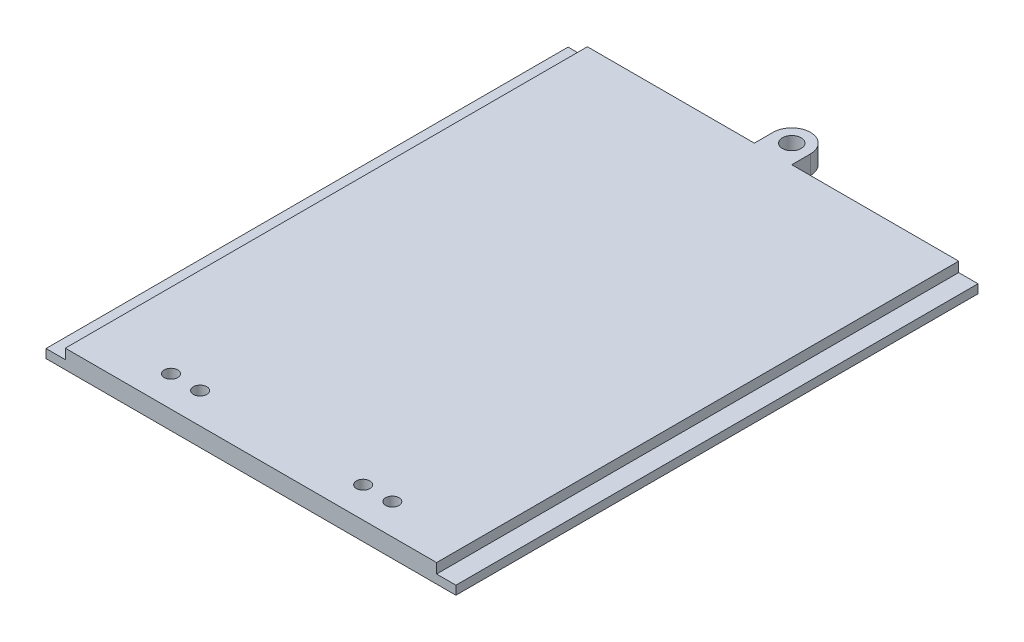
ISO-10303-21;
HEADER;
FILE_DESCRIPTION(('STEP AP214'),'2;1');
FILE_NAME('part.step','',(''),(''),'','','');
FILE_SCHEMA(('AUTOMOTIVE_DESIGN { 1 0 10303 214 1 1 1 1 }'));
ENDSEC;
DATA;
#1=APPLICATION_CONTEXT('core data for automotive mechanical design processes');
#2=APPLICATION_PROTOCOL_DEFINITION('international standard','automotive_design',2000,#1);
#3=PRODUCT_CONTEXT('',#1,'mechanical');
#4=PRODUCT('Part','Part','',(#3));
#5=PRODUCT_RELATED_PRODUCT_CATEGORY('part','',(#4));
#6=PRODUCT_DEFINITION_FORMATION('','',#4);
#7=PRODUCT_DEFINITION_CONTEXT('part definition',#1,'design');
#8=PRODUCT_DEFINITION('design','',#6,#7);
#9=PRODUCT_DEFINITION_SHAPE('','',#8);
#10=(LENGTH_UNIT() NAMED_UNIT(*) SI_UNIT(.MILLI.,.METRE.));
#11=(NAMED_UNIT(*) PLANE_ANGLE_UNIT() SI_UNIT($,.RADIAN.));
#12=(NAMED_UNIT(*) SI_UNIT($,.STERADIAN.) SOLID_ANGLE_UNIT());
#13=UNCERTAINTY_MEASURE_WITH_UNIT(LENGTH_MEASURE(1.E-05),#10,'distance_accuracy_value','');
#14=(GEOMETRIC_REPRESENTATION_CONTEXT(3) GLOBAL_UNCERTAINTY_ASSIGNED_CONTEXT((#13)) GLOBAL_UNIT_ASSIGNED_CONTEXT((#10,
#11,#12)) REPRESENTATION_CONTEXT('',''));
#15=CARTESIAN_POINT('',(0.,0.,0.));
#16=DIRECTION('',(0.,0.,1.));
#17=DIRECTION('',(1.,0.,0.));
#18=AXIS2_PLACEMENT_3D('',#15,#16,#17);
#19=CARTESIAN_POINT('',(0.,6.35,-177.292));
#20=DIRECTION('',(0.,0.,1.));
#21=DIRECTION('',(1.,0.,0.));
#22=AXIS2_PLACEMENT_3D('',#19,#20,#21);
#23=PLANE('',#22);
#24=DIRECTION('',(0.,1.,0.));
#25=VECTOR('',#24,1.);
#26=CARTESIAN_POINT('',(63.246,0.,-177.292));
#27=LINE('',#26,#25);
#28=CARTESIAN_POINT('',(63.246,0.,-177.292));
#29=VERTEX_POINT('',#28);
#30=CARTESIAN_POINT('',(63.246,6.35,-177.292));
#31=VERTEX_POINT('',#30);
#32=EDGE_CURVE('E134',#29,#31,#27,.T.);
#33=ORIENTED_EDGE('',*,*,#32,.F.);
#34=DIRECTION('',(-1.,0.,0.));
#35=VECTOR('',#34,1.);
#36=CARTESIAN_POINT('',(0.,0.,-177.292));
#37=LINE('',#36,#35);
#38=CARTESIAN_POINT('',(0.,0.,-177.292));
#39=VERTEX_POINT('',#38);
#40=EDGE_CURVE('E144',#29,#39,#37,.T.);
#41=ORIENTED_EDGE('',*,*,#40,.T.);
#42=DIRECTION('',(0.,-1.,0.));
#43=VECTOR('',#42,1.);
#44=CARTESIAN_POINT('',(0.,6.35,-177.292));
#45=LINE('',#44,#43);
#46=CARTESIAN_POINT('',(0.,2.975,-177.292));
#47=VERTEX_POINT('',#46);
#48=EDGE_CURVE('E165',#47,#39,#45,.T.);
#49=ORIENTED_EDGE('',*,*,#48,.F.);
#50=DIRECTION('',(-1.,0.,0.));
#51=VECTOR('',#50,1.);
#52=CARTESIAN_POINT('',(0.,2.975,-177.292));
#53=LINE('',#52,#51);
#54=CARTESIAN_POINT('',(6.55,2.975,-177.292));
#55=VERTEX_POINT('',#54);
#56=EDGE_CURVE('E218',#55,#47,#53,.T.);
#57=ORIENTED_EDGE('',*,*,#56,.F.);
#58=DIRECTION('',(0.,1.,0.));
#59=VECTOR('',#58,1.);
#60=CARTESIAN_POINT('',(6.55,2.975,-177.292));
#61=LINE('',#60,#59);
#62=CARTESIAN_POINT('',(6.55,6.35,-177.292));
#63=VERTEX_POINT('',#62);
#64=EDGE_CURVE('E224',#55,#63,#61,.T.);
#65=ORIENTED_EDGE('',*,*,#64,.T.);
#66=DIRECTION('',(-1.,0.,0.));
#67=VECTOR('',#66,1.);
#68=CARTESIAN_POINT('',(0.,6.35,-177.292));
#69=LINE('',#68,#67);
#70=EDGE_CURVE('E147',#31,#63,#69,.T.);
#71=ORIENTED_EDGE('',*,*,#70,.F.);
#72=EDGE_LOOP('',(#33,#41,#49,#57,#65,#71));
#73=FACE_BOUND('',#72,.T.);
#74=ADVANCED_FACE('F37',(#73),#23,.F.);
#75=CARTESIAN_POINT('',(0.,6.35,0.));
#76=DIRECTION('',(1.,0.,0.));
#77=DIRECTION('',(0.,0.,-1.));
#78=AXIS2_PLACEMENT_3D('',#75,#76,#77);
#79=PLANE('',#78);
#80=DIRECTION('',(0.,0.,1.));
#81=VECTOR('',#80,1.);
#82=CARTESIAN_POINT('',(0.,2.975,-177.292));
#83=LINE('',#82,#81);
#84=CARTESIAN_POINT('',(0.,2.975,0.));
#85=VERTEX_POINT('',#84);
#86=EDGE_CURVE('E209',#47,#85,#83,.T.);
#87=ORIENTED_EDGE('',*,*,#86,.F.);
#88=ORIENTED_EDGE('',*,*,#48,.T.);
#89=DIRECTION('',(0.,0.,1.));
#90=VECTOR('',#89,1.);
#91=CARTESIAN_POINT('',(0.,0.,0.));
#92=LINE('',#91,#90);
#93=CARTESIAN_POINT('',(0.,0.,0.));
#94=VERTEX_POINT('',#93);
#95=EDGE_CURVE('E154',#39,#94,#92,.T.);
#96=ORIENTED_EDGE('',*,*,#95,.T.);
#97=DIRECTION('',(0.,-1.,0.));
#98=VECTOR('',#97,1.);
#99=CARTESIAN_POINT('',(0.,6.35,0.));
#100=LINE('',#99,#98);
#101=EDGE_CURVE('E172',#85,#94,#100,.T.);
#102=ORIENTED_EDGE('',*,*,#101,.F.);
#103=EDGE_LOOP('',(#87,#88,#96,#102));
#104=FACE_BOUND('',#103,.T.);
#105=ADVANCED_FACE('F279',(#104),#79,.F.);
#106=CARTESIAN_POINT('',(139.192,6.35,0.));
#107=DIRECTION('',(-1.,0.,0.));
#108=DIRECTION('',(0.,0.,1.));
#109=AXIS2_PLACEMENT_3D('',#106,#107,#108);
#110=PLANE('',#109);
#111=DIRECTION('',(0.,0.,-1.));
#112=VECTOR('',#111,1.);
#113=CARTESIAN_POINT('',(139.192,2.975,-177.292));
#114=LINE('',#113,#112);
#115=CARTESIAN_POINT('',(139.192,2.975,0.));
#116=VERTEX_POINT('',#115);
#117=CARTESIAN_POINT('',(139.192,2.975,-177.292));
#118=VERTEX_POINT('',#117);
#119=EDGE_CURVE('E235',#116,#118,#114,.T.);
#120=ORIENTED_EDGE('',*,*,#119,.F.);
#121=DIRECTION('',(0.,-1.,0.));
#122=VECTOR('',#121,1.);
#123=CARTESIAN_POINT('',(139.192,6.35,0.));
#124=LINE('',#123,#122);
#125=CARTESIAN_POINT('',(139.192,0.,0.));
#126=VERTEX_POINT('',#125);
#127=EDGE_CURVE('E170',#116,#126,#124,.T.);
#128=ORIENTED_EDGE('',*,*,#127,.T.);
#129=DIRECTION('',(0.,0.,-1.));
#130=VECTOR('',#129,1.);
#131=CARTESIAN_POINT('',(139.192,0.,0.));
#132=LINE('',#131,#130);
#133=CARTESIAN_POINT('',(139.192,0.,-177.292));
#134=VERTEX_POINT('',#133);
#135=EDGE_CURVE('E156',#126,#134,#132,.T.);
#136=ORIENTED_EDGE('',*,*,#135,.T.);
#137=DIRECTION('',(0.,-1.,0.));
#138=VECTOR('',#137,1.);
#139=CARTESIAN_POINT('',(139.192,6.35,-177.292));
#140=LINE('',#139,#138);
#141=EDGE_CURVE('E167',#118,#134,#140,.T.);
#142=ORIENTED_EDGE('',*,*,#141,.F.);
#143=EDGE_LOOP('',(#120,#128,#136,#142));
#144=FACE_BOUND('',#143,.T.);
#145=ADVANCED_FACE('F259',(#144),#110,.F.);
#146=CARTESIAN_POINT('',(0.,6.35,0.));
#147=DIRECTION('',(0.,0.,-1.));
#148=DIRECTION('',(-1.,0.,0.));
#149=AXIS2_PLACEMENT_3D('',#146,#147,#148);
#150=PLANE('',#149);
#151=DIRECTION('',(1.,0.,0.));
#152=VECTOR('',#151,1.);
#153=CARTESIAN_POINT('',(0.,6.35,0.));
#154=LINE('',#153,#152);
#155=CARTESIAN_POINT('',(6.55000000000002,6.35,0.));
#156=VERTEX_POINT('',#155);
#157=CARTESIAN_POINT('',(132.642,6.35,0.));
#158=VERTEX_POINT('',#157);
#159=EDGE_CURVE('E159',#156,#158,#154,.T.);
#160=ORIENTED_EDGE('',*,*,#159,.F.);
#161=DIRECTION('',(0.,1.,0.));
#162=VECTOR('',#161,1.);
#163=CARTESIAN_POINT('',(6.55000000000002,2.975,0.));
#164=LINE('',#163,#162);
#165=CARTESIAN_POINT('',(6.55000000000002,2.975,0.));
#166=VERTEX_POINT('',#165);
#167=EDGE_CURVE('E220',#166,#156,#164,.T.);
#168=ORIENTED_EDGE('',*,*,#167,.F.);
#169=DIRECTION('',(1.,0.,0.));
#170=VECTOR('',#169,1.);
#171=CARTESIAN_POINT('',(0.,2.975,0.));
#172=LINE('',#171,#170);
#173=EDGE_CURVE('E211',#85,#166,#172,.T.);
#174=ORIENTED_EDGE('',*,*,#173,.F.);
#175=ORIENTED_EDGE('',*,*,#101,.T.);
#176=DIRECTION('',(1.,0.,0.));
#177=VECTOR('',#176,1.);
#178=CARTESIAN_POINT('',(0.,0.,0.));
#179=LINE('',#178,#177);
#180=EDGE_CURVE('E161',#94,#126,#179,.T.);
#181=ORIENTED_EDGE('',*,*,#180,.T.);
#182=ORIENTED_EDGE('',*,*,#127,.F.);
#183=DIRECTION('',(1.,0.,0.));
#184=VECTOR('',#183,1.);
#185=CARTESIAN_POINT('',(139.192,2.975,0.));
#186=LINE('',#185,#184);
#187=CARTESIAN_POINT('',(132.642,2.975,0.));
#188=VERTEX_POINT('',#187);
#189=EDGE_CURVE('E233',#188,#116,#186,.T.);
#190=ORIENTED_EDGE('',*,*,#189,.F.);
#191=DIRECTION('',(0.,1.,0.));
#192=VECTOR('',#191,1.);
#193=CARTESIAN_POINT('',(132.642,2.975,0.));
#194=LINE('',#193,#192);
#195=EDGE_CURVE('E223',#188,#158,#194,.T.);
#196=ORIENTED_EDGE('',*,*,#195,.T.);
#197=EDGE_LOOP('',(#160,#168,#174,#175,#181,#182,#190,#196));
#198=FACE_BOUND('',#197,.T.);
#199=ADVANCED_FACE('F251',(#198),#150,.F.);
#200=CARTESIAN_POINT('',(75.946,0.,-177.292));
#201=VERTEX_POINT('',#200);
#202=EDGE_CURVE('E155',#134,#201,#37,.T.);
#203=ORIENTED_EDGE('',*,*,#202,.T.);
#204=DIRECTION('',(0.,1.,0.));
#205=VECTOR('',#204,1.);
#206=CARTESIAN_POINT('',(75.946,0.,-177.292));
#207=LINE('',#206,#205);
#208=CARTESIAN_POINT('',(75.946,6.35,-177.292));
#209=VERTEX_POINT('',#208);
#210=EDGE_CURVE('E148',#201,#209,#207,.T.);
#211=ORIENTED_EDGE('',*,*,#210,.T.);
#212=CARTESIAN_POINT('',(132.642,6.35,-177.292));
#213=VERTEX_POINT('',#212);
#214=EDGE_CURVE('E168',#213,#209,#69,.T.);
#215=ORIENTED_EDGE('',*,*,#214,.F.);
#216=DIRECTION('',(0.,1.,0.));
#217=VECTOR('',#216,1.);
#218=CARTESIAN_POINT('',(132.642,2.975,-177.292));
#219=LINE('',#218,#217);
#220=CARTESIAN_POINT('',(132.642,2.975,-177.292));
#221=VERTEX_POINT('',#220);
#222=EDGE_CURVE('E237',#221,#213,#219,.T.);
#223=ORIENTED_EDGE('',*,*,#222,.F.);
#224=DIRECTION('',(-1.,0.,0.));
#225=VECTOR('',#224,1.);
#226=CARTESIAN_POINT('',(139.192,2.975,-177.292));
#227=LINE('',#226,#225);
#228=EDGE_CURVE('E227',#118,#221,#227,.T.);
#229=ORIENTED_EDGE('',*,*,#228,.F.);
#230=ORIENTED_EDGE('',*,*,#141,.T.);
#231=EDGE_LOOP('',(#203,#211,#215,#223,#229,#230));
#232=FACE_BOUND('',#231,.T.);
#233=ADVANCED_FACE('F265',(#232),#23,.F.);
#234=CARTESIAN_POINT('',(0.,6.35,0.));
#235=DIRECTION('',(0.,-1.,0.));
#236=DIRECTION('',(0.,0.,-1.));
#237=AXIS2_PLACEMENT_3D('',#234,#235,#236);
#238=PLANE('',#237);
#239=CARTESIAN_POINT('',(107.188,6.35,-10.414));
#240=DIRECTION('',(0.,-1.,0.));
#241=DIRECTION('',(0.,0.,-1.));
#242=AXIS2_PLACEMENT_3D('',#239,#240,#241);
#243=CIRCLE('',#242,2.28599999999999);
#244=CARTESIAN_POINT('',(107.188,6.35,-12.7));
#245=VERTEX_POINT('',#244);
#246=EDGE_CURVE('E199',#245,#245,#243,.T.);
#247=ORIENTED_EDGE('',*,*,#246,.T.);
#248=EDGE_LOOP('',(#247));
#249=FACE_BOUND('',#248,.T.);
#250=CARTESIAN_POINT('',(97.282,6.35,-10.414));
#251=DIRECTION('',(0.,-1.,0.));
#252=DIRECTION('',(0.,0.,-1.));
#253=AXIS2_PLACEMENT_3D('',#250,#251,#252);
#254=CIRCLE('',#253,2.28599999999999);
#255=CARTESIAN_POINT('',(97.282,6.35,-12.7));
#256=VERTEX_POINT('',#255);
#257=EDGE_CURVE('E451',#256,#256,#254,.T.);
#258=ORIENTED_EDGE('',*,*,#257,.T.);
#259=EDGE_LOOP('',(#258));
#260=FACE_BOUND('',#259,.T.);
#261=CARTESIAN_POINT('',(41.91,6.35,-10.414));
#262=DIRECTION('',(0.,-1.,0.));
#263=DIRECTION('',(0.,0.,-1.));
#264=AXIS2_PLACEMENT_3D('',#261,#262,#263);
#265=CIRCLE('',#264,2.28599999999999);
#266=CARTESIAN_POINT('',(41.91,6.35,-12.7));
#267=VERTEX_POINT('',#266);
#268=EDGE_CURVE('E453',#267,#267,#265,.T.);
#269=ORIENTED_EDGE('',*,*,#268,.T.);
#270=EDGE_LOOP('',(#269));
#271=FACE_BOUND('',#270,.T.);
#272=CARTESIAN_POINT('',(32.004,6.35,-10.414));
#273=DIRECTION('',(0.,-1.,0.));
#274=DIRECTION('',(0.,0.,-1.));
#275=AXIS2_PLACEMENT_3D('',#272,#273,#274);
#276=CIRCLE('',#275,2.28599999999999);
#277=CARTESIAN_POINT('',(32.004,6.35,-12.7));
#278=VERTEX_POINT('',#277);
#279=EDGE_CURVE('E457',#278,#278,#276,.T.);
#280=ORIENTED_EDGE('',*,*,#279,.T.);
#281=EDGE_LOOP('',(#280));
#282=FACE_BOUND('',#281,.T.);
#283=CARTESIAN_POINT('',(69.596,6.35,-183.642));
#284=DIRECTION('',(0.,1.,0.));
#285=DIRECTION('',(0.,0.,1.));
#286=AXIS2_PLACEMENT_3D('',#283,#284,#285);
#287=CIRCLE('',#286,3.175);
#288=CARTESIAN_POINT('',(69.596,6.35,-180.467));
#289=VERTEX_POINT('',#288);
#290=EDGE_CURVE('E194',#289,#289,#287,.T.);
#291=ORIENTED_EDGE('',*,*,#290,.F.);
#292=EDGE_LOOP('',(#291));
#293=FACE_BOUND('',#292,.T.);
#294=CARTESIAN_POINT('',(69.596,6.35,-183.642));
#295=DIRECTION('',(0.,-1.,0.));
#296=DIRECTION('',(0.,0.,-1.));
#297=AXIS2_PLACEMENT_3D('',#294,#295,#296);
#298=CIRCLE('',#297,6.35);
#299=CARTESIAN_POINT('',(75.946,6.35,-183.642));
#300=VERTEX_POINT('',#299);
#301=CARTESIAN_POINT('',(69.596,6.35,-189.992));
#302=VERTEX_POINT('',#301);
#303=EDGE_CURVE('E174',#300,#302,#298,.F.);
#304=ORIENTED_EDGE('',*,*,#303,.T.);
#305=CARTESIAN_POINT('',(69.596,6.35,-183.642));
#306=DIRECTION('',(0.,-1.,0.));
#307=DIRECTION('',(0.,0.,-1.));
#308=AXIS2_PLACEMENT_3D('',#305,#306,#307);
#309=CIRCLE('',#308,6.35);
#310=CARTESIAN_POINT('',(63.246,6.35,-183.642));
#311=VERTEX_POINT('',#310);
#312=EDGE_CURVE('E176',#302,#311,#309,.F.);
#313=ORIENTED_EDGE('',*,*,#312,.T.);
#314=DIRECTION('',(0.,0.,1.));
#315=VECTOR('',#314,1.);
#316=CARTESIAN_POINT('',(63.246,6.35,-177.292));
#317=LINE('',#316,#315);
#318=EDGE_CURVE('E183',#311,#31,#317,.T.);
#319=ORIENTED_EDGE('',*,*,#318,.T.);
#320=ORIENTED_EDGE('',*,*,#70,.T.);
#321=DIRECTION('',(0.,0.,-1.));
#322=VECTOR('',#321,1.);
#323=CARTESIAN_POINT('',(6.55,6.35,-177.292));
#324=LINE('',#323,#322);
#325=EDGE_CURVE('E212',#156,#63,#324,.T.);
#326=ORIENTED_EDGE('',*,*,#325,.F.);
#327=ORIENTED_EDGE('',*,*,#159,.T.);
#328=DIRECTION('',(0.,0.,1.));
#329=VECTOR('',#328,1.);
#330=CARTESIAN_POINT('',(132.642,6.35,-177.292));
#331=LINE('',#330,#329);
#332=EDGE_CURVE('E207',#213,#158,#331,.T.);
#333=ORIENTED_EDGE('',*,*,#332,.F.);
#334=ORIENTED_EDGE('',*,*,#214,.T.);
#335=DIRECTION('',(0.,0.,-1.));
#336=VECTOR('',#335,1.);
#337=CARTESIAN_POINT('',(75.946,6.35,-177.292));
#338=LINE('',#337,#336);
#339=EDGE_CURVE('E140',#209,#300,#338,.T.);
#340=ORIENTED_EDGE('',*,*,#339,.T.);
#341=EDGE_LOOP('',(#304,#313,#319,#320,#326,#327,#333,#334,#340));
#342=FACE_BOUND('',#341,.T.);
#343=ADVANCED_FACE('F182',(#249,#260,#271,#282,#293,#342),#238,.F.);
#344=CARTESIAN_POINT('',(0.,0.,0.));
#345=DIRECTION('',(0.,-1.,0.));
#346=DIRECTION('',(0.,0.,-1.));
#347=AXIS2_PLACEMENT_3D('',#344,#345,#346);
#348=PLANE('',#347);
#349=CARTESIAN_POINT('',(107.188,0.,-10.414));
#350=DIRECTION('',(0.,-1.,0.));
#351=DIRECTION('',(0.,0.,-1.));
#352=AXIS2_PLACEMENT_3D('',#349,#350,#351);
#353=CIRCLE('',#352,2.28599999999999);
#354=CARTESIAN_POINT('',(107.188,0.,-12.7));
#355=VERTEX_POINT('',#354);
#356=EDGE_CURVE('E448',#355,#355,#353,.T.);
#357=ORIENTED_EDGE('',*,*,#356,.F.);
#358=EDGE_LOOP('',(#357));
#359=FACE_BOUND('',#358,.T.);
#360=CARTESIAN_POINT('',(97.282,0.,-10.414));
#361=DIRECTION('',(0.,-1.,0.));
#362=DIRECTION('',(0.,0.,-1.));
#363=AXIS2_PLACEMENT_3D('',#360,#361,#362);
#364=CIRCLE('',#363,2.28599999999999);
#365=CARTESIAN_POINT('',(97.282,0.,-12.7));
#366=VERTEX_POINT('',#365);
#367=EDGE_CURVE('E468',#366,#366,#364,.T.);
#368=ORIENTED_EDGE('',*,*,#367,.F.);
#369=EDGE_LOOP('',(#368));
#370=FACE_BOUND('',#369,.T.);
#371=CARTESIAN_POINT('',(41.91,0.,-10.414));
#372=DIRECTION('',(0.,-1.,0.));
#373=DIRECTION('',(0.,0.,-1.));
#374=AXIS2_PLACEMENT_3D('',#371,#372,#373);
#375=CIRCLE('',#374,2.28599999999999);
#376=CARTESIAN_POINT('',(41.91,0.,-12.7));
#377=VERTEX_POINT('',#376);
#378=EDGE_CURVE('E465',#377,#377,#375,.T.);
#379=ORIENTED_EDGE('',*,*,#378,.F.);
#380=EDGE_LOOP('',(#379));
#381=FACE_BOUND('',#380,.T.);
#382=CARTESIAN_POINT('',(32.004,0.,-10.414));
#383=DIRECTION('',(0.,-1.,0.));
#384=DIRECTION('',(0.,0.,-1.));
#385=AXIS2_PLACEMENT_3D('',#382,#383,#384);
#386=CIRCLE('',#385,2.28599999999999);
#387=CARTESIAN_POINT('',(32.004,0.,-12.7));
#388=VERTEX_POINT('',#387);
#389=EDGE_CURVE('E462',#388,#388,#386,.T.);
#390=ORIENTED_EDGE('',*,*,#389,.F.);
#391=EDGE_LOOP('',(#390));
#392=FACE_BOUND('',#391,.T.);
#393=CARTESIAN_POINT('',(69.596,0.,-183.642));
#394=DIRECTION('',(0.,1.,0.));
#395=DIRECTION('',(0.,0.,1.));
#396=AXIS2_PLACEMENT_3D('',#393,#394,#395);
#397=CIRCLE('',#396,3.175);
#398=CARTESIAN_POINT('',(69.596,0.,-180.467));
#399=VERTEX_POINT('',#398);
#400=EDGE_CURVE('E192',#399,#399,#397,.T.);
#401=ORIENTED_EDGE('',*,*,#400,.T.);
#402=EDGE_LOOP('',(#401));
#403=FACE_BOUND('',#402,.T.);
#404=DIRECTION('',(0.,0.,1.));
#405=VECTOR('',#404,1.);
#406=CARTESIAN_POINT('',(63.246,0.,-177.292));
#407=LINE('',#406,#405);
#408=CARTESIAN_POINT('',(63.246,0.,-183.642));
#409=VERTEX_POINT('',#408);
#410=EDGE_CURVE('E130',#409,#29,#407,.T.);
#411=ORIENTED_EDGE('',*,*,#410,.F.);
#412=CARTESIAN_POINT('',(69.596,0.,-183.642));
#413=DIRECTION('',(0.,-1.,0.));
#414=DIRECTION('',(0.,0.,-1.));
#415=AXIS2_PLACEMENT_3D('',#412,#413,#414);
#416=CIRCLE('',#415,6.35);
#417=CARTESIAN_POINT('',(69.596,0.,-189.992));
#418=VERTEX_POINT('',#417);
#419=EDGE_CURVE('E46',#409,#418,#416,.T.);
#420=ORIENTED_EDGE('',*,*,#419,.T.);
#421=CARTESIAN_POINT('',(69.596,0.,-183.642));
#422=DIRECTION('',(0.,-1.,0.));
#423=DIRECTION('',(0.,0.,-1.));
#424=AXIS2_PLACEMENT_3D('',#421,#422,#423);
#425=CIRCLE('',#424,6.35);
#426=CARTESIAN_POINT('',(75.946,0.,-183.642));
#427=VERTEX_POINT('',#426);
#428=EDGE_CURVE('E53',#418,#427,#425,.T.);
#429=ORIENTED_EDGE('',*,*,#428,.T.);
#430=DIRECTION('',(0.,0.,-1.));
#431=VECTOR('',#430,1.);
#432=CARTESIAN_POINT('',(75.946,0.,-177.292));
#433=LINE('',#432,#431);
#434=EDGE_CURVE('E139',#201,#427,#433,.T.);
#435=ORIENTED_EDGE('',*,*,#434,.F.);
#436=ORIENTED_EDGE('',*,*,#202,.F.);
#437=ORIENTED_EDGE('',*,*,#135,.F.);
#438=ORIENTED_EDGE('',*,*,#180,.F.);
#439=ORIENTED_EDGE('',*,*,#95,.F.);
#440=ORIENTED_EDGE('',*,*,#40,.F.);
#441=EDGE_LOOP('',(#411,#420,#429,#435,#436,#437,#438,#439,#440));
#442=FACE_BOUND('',#441,.T.);
#443=ADVANCED_FACE('F151',(#359,#370,#381,#392,#403,#442),#348,.T.);
#444=CARTESIAN_POINT('',(132.642,2.975,-177.292));
#445=DIRECTION('',(-1.,0.,0.));
#446=DIRECTION('',(0.,0.,1.));
#447=AXIS2_PLACEMENT_3D('',#444,#445,#446);
#448=PLANE('',#447);
#449=ORIENTED_EDGE('',*,*,#332,.T.);
#450=ORIENTED_EDGE('',*,*,#195,.F.);
#451=DIRECTION('',(0.,0.,1.));
#452=VECTOR('',#451,1.);
#453=CARTESIAN_POINT('',(132.642,2.975,-177.292));
#454=LINE('',#453,#452);
#455=EDGE_CURVE('E230',#221,#188,#454,.T.);
#456=ORIENTED_EDGE('',*,*,#455,.F.);
#457=ORIENTED_EDGE('',*,*,#222,.T.);
#458=EDGE_LOOP('',(#449,#450,#456,#457));
#459=FACE_BOUND('',#458,.T.);
#460=ADVANCED_FACE('F269',(#459),#448,.F.);
#461=CARTESIAN_POINT('',(0.,2.975,0.));
#462=DIRECTION('',(0.,1.,0.));
#463=DIRECTION('',(0.,0.,1.));
#464=AXIS2_PLACEMENT_3D('',#461,#462,#463);
#465=PLANE('',#464);
#466=ORIENTED_EDGE('',*,*,#228,.T.);
#467=ORIENTED_EDGE('',*,*,#455,.T.);
#468=ORIENTED_EDGE('',*,*,#189,.T.);
#469=ORIENTED_EDGE('',*,*,#119,.T.);
#470=EDGE_LOOP('',(#466,#467,#468,#469));
#471=FACE_BOUND('',#470,.T.);
#472=ADVANCED_FACE('F262',(#471),#465,.T.);
#473=CARTESIAN_POINT('',(6.55,2.975,-177.292));
#474=DIRECTION('',(1.,0.,0.));
#475=DIRECTION('',(0.,0.,-1.));
#476=AXIS2_PLACEMENT_3D('',#473,#474,#475);
#477=PLANE('',#476);
#478=ORIENTED_EDGE('',*,*,#325,.T.);
#479=ORIENTED_EDGE('',*,*,#64,.F.);
#480=DIRECTION('',(0.,0.,-1.));
#481=VECTOR('',#480,1.);
#482=CARTESIAN_POINT('',(6.55,2.975,-177.292));
#483=LINE('',#482,#481);
#484=EDGE_CURVE('E215',#166,#55,#483,.T.);
#485=ORIENTED_EDGE('',*,*,#484,.F.);
#486=ORIENTED_EDGE('',*,*,#167,.T.);
#487=EDGE_LOOP('',(#478,#479,#485,#486));
#488=FACE_BOUND('',#487,.T.);
#489=ADVANCED_FACE('F273',(#488),#477,.F.);
#490=CARTESIAN_POINT('',(0.,2.975,0.));
#491=DIRECTION('',(0.,1.,0.));
#492=DIRECTION('',(0.,0.,1.));
#493=AXIS2_PLACEMENT_3D('',#490,#491,#492);
#494=PLANE('',#493);
#495=ORIENTED_EDGE('',*,*,#86,.T.);
#496=ORIENTED_EDGE('',*,*,#173,.T.);
#497=ORIENTED_EDGE('',*,*,#484,.T.);
#498=ORIENTED_EDGE('',*,*,#56,.T.);
#499=EDGE_LOOP('',(#495,#496,#497,#498));
#500=FACE_BOUND('',#499,.T.);
#501=ADVANCED_FACE('F276',(#500),#494,.T.);
#502=CARTESIAN_POINT('',(63.246,0.,-177.292));
#503=DIRECTION('',(-1.,0.,0.));
#504=DIRECTION('',(0.,0.,1.));
#505=AXIS2_PLACEMENT_3D('',#502,#503,#504);
#506=PLANE('',#505);
#507=ORIENTED_EDGE('',*,*,#318,.F.);
#508=DIRECTION('',(0.,1.,0.));
#509=VECTOR('',#508,1.);
#510=CARTESIAN_POINT('',(63.246,0.,-183.642));
#511=LINE('',#510,#509);
#512=EDGE_CURVE('E137',#311,#409,#511,.F.);
#513=ORIENTED_EDGE('',*,*,#512,.T.);
#514=ORIENTED_EDGE('',*,*,#410,.T.);
#515=ORIENTED_EDGE('',*,*,#32,.T.);
#516=EDGE_LOOP('',(#507,#513,#514,#515));
#517=FACE_BOUND('',#516,.T.);
#518=ADVANCED_FACE('F133',(#517),#506,.T.);
#519=CARTESIAN_POINT('',(75.946,0.,-177.292));
#520=DIRECTION('',(1.,0.,0.));
#521=DIRECTION('',(0.,0.,-1.));
#522=AXIS2_PLACEMENT_3D('',#519,#520,#521);
#523=PLANE('',#522);
#524=ORIENTED_EDGE('',*,*,#434,.T.);
#525=DIRECTION('',(0.,1.,0.));
#526=VECTOR('',#525,1.);
#527=CARTESIAN_POINT('',(75.946,0.,-183.642));
#528=LINE('',#527,#526);
#529=EDGE_CURVE('E11',#427,#300,#528,.T.);
#530=ORIENTED_EDGE('',*,*,#529,.T.);
#531=ORIENTED_EDGE('',*,*,#339,.F.);
#532=ORIENTED_EDGE('',*,*,#210,.F.);
#533=EDGE_LOOP('',(#524,#530,#531,#532));
#534=FACE_BOUND('',#533,.T.);
#535=ADVANCED_FACE('F298',(#534),#523,.T.);
#536=CARTESIAN_POINT('',(69.596,0.,-183.642));
#537=DIRECTION('',(0.,1.,0.));
#538=DIRECTION('',(0.,0.,1.));
#539=AXIS2_PLACEMENT_3D('',#536,#537,#538);
#540=CYLINDRICAL_SURFACE('',#539,6.35);
#541=ORIENTED_EDGE('',*,*,#529,.F.);
#542=ORIENTED_EDGE('',*,*,#428,.F.);
#543=DIRECTION('',(0.,1.,0.));
#544=VECTOR('',#543,1.);
#545=CARTESIAN_POINT('',(69.596,0.,-189.992));
#546=LINE('',#545,#544);
#547=EDGE_CURVE('E41',#302,#418,#546,.F.);
#548=ORIENTED_EDGE('',*,*,#547,.F.);
#549=ORIENTED_EDGE('',*,*,#303,.F.);
#550=EDGE_LOOP('',(#541,#542,#548,#549));
#551=FACE_BOUND('',#550,.T.);
#552=ADVANCED_FACE('F39',(#551),#540,.T.);
#553=CARTESIAN_POINT('',(69.596,0.,-183.642));
#554=DIRECTION('',(0.,1.,0.));
#555=DIRECTION('',(0.,0.,1.));
#556=AXIS2_PLACEMENT_3D('',#553,#554,#555);
#557=CYLINDRICAL_SURFACE('',#556,6.35);
#558=ORIENTED_EDGE('',*,*,#419,.F.);
#559=ORIENTED_EDGE('',*,*,#512,.F.);
#560=ORIENTED_EDGE('',*,*,#312,.F.);
#561=ORIENTED_EDGE('',*,*,#547,.T.);
#562=EDGE_LOOP('',(#558,#559,#560,#561));
#563=FACE_BOUND('',#562,.T.);
#564=ADVANCED_FACE('F190',(#563),#557,.T.);
#565=CARTESIAN_POINT('',(69.596,0.,-183.642));
#566=DIRECTION('',(0.,1.,0.));
#567=DIRECTION('',(0.,0.,1.));
#568=AXIS2_PLACEMENT_3D('',#565,#566,#567);
#569=CYLINDRICAL_SURFACE('',#568,3.175);
#570=ORIENTED_EDGE('',*,*,#400,.F.);
#571=EDGE_LOOP('',(#570));
#572=FACE_BOUND('',#571,.T.);
#573=ORIENTED_EDGE('',*,*,#290,.T.);
#574=EDGE_LOOP('',(#573));
#575=FACE_BOUND('',#574,.T.);
#576=ADVANCED_FACE('F290',(#572,#575),#569,.F.);
#577=CARTESIAN_POINT('',(32.004,12.7,-10.414));
#578=DIRECTION('',(0.,-1.,0.));
#579=DIRECTION('',(0.,0.,-1.));
#580=AXIS2_PLACEMENT_3D('',#577,#578,#579);
#581=CYLINDRICAL_SURFACE('',#580,2.28599999999999);
#582=ORIENTED_EDGE('',*,*,#389,.T.);
#583=EDGE_LOOP('',(#582));
#584=FACE_BOUND('',#583,.T.);
#585=ORIENTED_EDGE('',*,*,#279,.F.);
#586=EDGE_LOOP('',(#585));
#587=FACE_BOUND('',#586,.T.);
#588=ADVANCED_FACE('F295',(#584,#587),#581,.F.);
#589=CARTESIAN_POINT('',(41.91,12.7,-10.414));
#590=DIRECTION('',(0.,-1.,0.));
#591=DIRECTION('',(0.,0.,-1.));
#592=AXIS2_PLACEMENT_3D('',#589,#590,#591);
#593=CYLINDRICAL_SURFACE('',#592,2.28599999999999);
#594=ORIENTED_EDGE('',*,*,#378,.T.);
#595=EDGE_LOOP('',(#594));
#596=FACE_BOUND('',#595,.T.);
#597=ORIENTED_EDGE('',*,*,#268,.F.);
#598=EDGE_LOOP('',(#597));
#599=FACE_BOUND('',#598,.T.);
#600=ADVANCED_FACE('F412',(#596,#599),#593,.F.);
#601=CARTESIAN_POINT('',(97.282,12.7,-10.414));
#602=DIRECTION('',(0.,-1.,0.));
#603=DIRECTION('',(0.,0.,-1.));
#604=AXIS2_PLACEMENT_3D('',#601,#602,#603);
#605=CYLINDRICAL_SURFACE('',#604,2.28599999999999);
#606=ORIENTED_EDGE('',*,*,#367,.T.);
#607=EDGE_LOOP('',(#606));
#608=FACE_BOUND('',#607,.T.);
#609=ORIENTED_EDGE('',*,*,#257,.F.);
#610=EDGE_LOOP('',(#609));
#611=FACE_BOUND('',#610,.T.);
#612=ADVANCED_FACE('F420',(#608,#611),#605,.F.);
#613=CARTESIAN_POINT('',(107.188,12.7,-10.414));
#614=DIRECTION('',(0.,-1.,0.));
#615=DIRECTION('',(0.,0.,-1.));
#616=AXIS2_PLACEMENT_3D('',#613,#614,#615);
#617=CYLINDRICAL_SURFACE('',#616,2.28599999999999);
#618=ORIENTED_EDGE('',*,*,#356,.T.);
#619=EDGE_LOOP('',(#618));
#620=FACE_BOUND('',#619,.T.);
#621=ORIENTED_EDGE('',*,*,#246,.F.);
#622=EDGE_LOOP('',(#621));
#623=FACE_BOUND('',#622,.T.);
#624=ADVANCED_FACE('F429',(#620,#623),#617,.F.);
#625=CLOSED_SHELL('',(#74,#105,#145,#199,#233,#343,#443,#460,#472,#489,#501,#518,#535,#552,#564,
#576,#588,#600,#612,#624));
#626=MANIFOLD_SOLID_BREP('B2',#625);
#627=ADVANCED_BREP_SHAPE_REPRESENTATION('',(#18,#626),#14);
#628=SHAPE_DEFINITION_REPRESENTATION(#9,#627);
ENDSEC;
END-ISO-10303-21;
